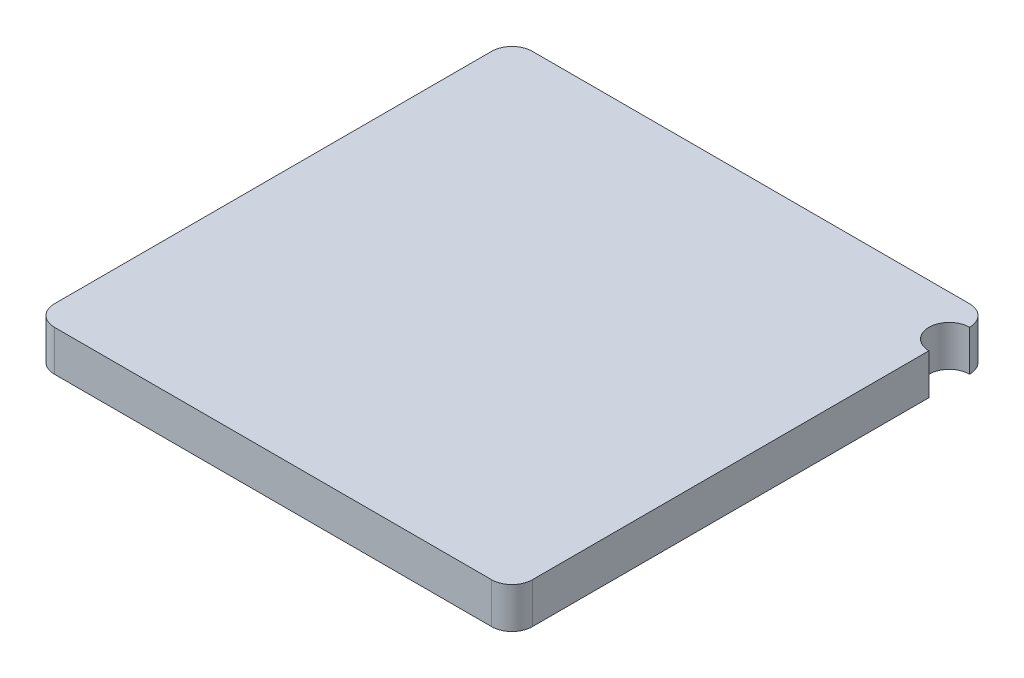
ISO-10303-21;
HEADER;
FILE_DESCRIPTION(('STEP AP214'),'2;1');
FILE_NAME('part.step','',(''),(''),'','','');
FILE_SCHEMA(('AUTOMOTIVE_DESIGN { 1 0 10303 214 1 1 1 1 }'));
ENDSEC;
DATA;
#1=APPLICATION_CONTEXT('core data for automotive mechanical design processes');
#2=APPLICATION_PROTOCOL_DEFINITION('international standard','automotive_design',2000,#1);
#3=PRODUCT_CONTEXT('',#1,'mechanical');
#4=PRODUCT('Part','Part','',(#3));
#5=PRODUCT_RELATED_PRODUCT_CATEGORY('part','',(#4));
#6=PRODUCT_DEFINITION_FORMATION('','',#4);
#7=PRODUCT_DEFINITION_CONTEXT('part definition',#1,'design');
#8=PRODUCT_DEFINITION('design','',#6,#7);
#9=PRODUCT_DEFINITION_SHAPE('','',#8);
#10=(LENGTH_UNIT() NAMED_UNIT(*) SI_UNIT(.MILLI.,.METRE.));
#11=(NAMED_UNIT(*) PLANE_ANGLE_UNIT() SI_UNIT($,.RADIAN.));
#12=(NAMED_UNIT(*) SI_UNIT($,.STERADIAN.) SOLID_ANGLE_UNIT());
#13=UNCERTAINTY_MEASURE_WITH_UNIT(LENGTH_MEASURE(1.E-05),#10,'distance_accuracy_value','');
#14=(GEOMETRIC_REPRESENTATION_CONTEXT(3) GLOBAL_UNCERTAINTY_ASSIGNED_CONTEXT((#13)) GLOBAL_UNIT_ASSIGNED_CONTEXT((#10,
#11,#12)) REPRESENTATION_CONTEXT('',''));
#15=CARTESIAN_POINT('',(0.,0.,0.));
#16=DIRECTION('',(0.,0.,1.));
#17=DIRECTION('',(1.,0.,0.));
#18=AXIS2_PLACEMENT_3D('',#15,#16,#17);
#19=CARTESIAN_POINT('',(1.175,0.2,-1.175));
#20=DIRECTION('',(-1.,0.,0.));
#21=DIRECTION('',(0.,0.,1.));
#22=AXIS2_PLACEMENT_3D('',#19,#20,#21);
#23=PLANE('',#22);
#24=DIRECTION('',(0.,0.,-1.));
#25=VECTOR('',#24,1.);
#26=CARTESIAN_POINT('',(1.175,0.,-1.175));
#27=LINE('',#26,#25);
#28=CARTESIAN_POINT('',(1.175,0.,1.075));
#29=VERTEX_POINT('',#28);
#30=CARTESIAN_POINT('',(1.175,0.,-0.875));
#31=VERTEX_POINT('',#30);
#32=EDGE_CURVE('E131',#29,#31,#27,.T.);
#33=ORIENTED_EDGE('',*,*,#32,.T.);
#34=DIRECTION('',(0.,1.,0.));
#35=VECTOR('',#34,1.);
#36=CARTESIAN_POINT('',(1.175,0.,-0.875));
#37=LINE('',#36,#35);
#38=CARTESIAN_POINT('',(1.175,0.2,-0.875));
#39=VERTEX_POINT('',#38);
#40=EDGE_CURVE('E115',#31,#39,#37,.T.);
#41=ORIENTED_EDGE('',*,*,#40,.T.);
#42=DIRECTION('',(0.,0.,-1.));
#43=VECTOR('',#42,1.);
#44=CARTESIAN_POINT('',(1.175,0.2,-1.175));
#45=LINE('',#44,#43);
#46=CARTESIAN_POINT('',(1.175,0.2,1.075));
#47=VERTEX_POINT('',#46);
#48=EDGE_CURVE('E128',#47,#39,#45,.T.);
#49=ORIENTED_EDGE('',*,*,#48,.F.);
#50=DIRECTION('',(0.,-1.,0.));
#51=VECTOR('',#50,1.);
#52=CARTESIAN_POINT('',(1.175,0.2,1.075));
#53=LINE('',#52,#51);
#54=EDGE_CURVE('E165',#47,#29,#53,.T.);
#55=ORIENTED_EDGE('',*,*,#54,.T.);
#56=EDGE_LOOP('',(#33,#41,#49,#55));
#57=FACE_BOUND('',#56,.T.);
#58=ADVANCED_FACE('F39',(#57),#23,.F.);
#59=CARTESIAN_POINT('',(-1.175,0.2,-1.175));
#60=DIRECTION('',(0.,0.,1.));
#61=DIRECTION('',(1.,0.,0.));
#62=AXIS2_PLACEMENT_3D('',#59,#60,#61);
#63=PLANE('',#62);
#64=DIRECTION('',(-1.,0.,0.));
#65=VECTOR('',#64,1.);
#66=CARTESIAN_POINT('',(-1.175,0.2,-1.175));
#67=LINE('',#66,#65);
#68=CARTESIAN_POINT('',(1.075,0.2,-1.175));
#69=VERTEX_POINT('',#68);
#70=CARTESIAN_POINT('',(-1.075,0.2,-1.175));
#71=VERTEX_POINT('',#70);
#72=EDGE_CURVE('E139',#69,#71,#67,.T.);
#73=ORIENTED_EDGE('',*,*,#72,.F.);
#74=DIRECTION('',(0.,-1.,0.));
#75=VECTOR('',#74,1.);
#76=CARTESIAN_POINT('',(1.075,0.2,-1.175));
#77=LINE('',#76,#75);
#78=CARTESIAN_POINT('',(1.075,0.,-1.175));
#79=VERTEX_POINT('',#78);
#80=EDGE_CURVE('E11',#69,#79,#77,.T.);
#81=ORIENTED_EDGE('',*,*,#80,.T.);
#82=DIRECTION('',(-1.,0.,0.));
#83=VECTOR('',#82,1.);
#84=CARTESIAN_POINT('',(-1.175,0.,-1.175));
#85=LINE('',#84,#83);
#86=CARTESIAN_POINT('',(-1.075,0.,-1.175));
#87=VERTEX_POINT('',#86);
#88=EDGE_CURVE('E157',#79,#87,#85,.T.);
#89=ORIENTED_EDGE('',*,*,#88,.T.);
#90=DIRECTION('',(0.,-1.,0.));
#91=VECTOR('',#90,1.);
#92=CARTESIAN_POINT('',(-1.075,0.2,-1.175));
#93=LINE('',#92,#91);
#94=EDGE_CURVE('E48',#87,#71,#93,.F.);
#95=ORIENTED_EDGE('',*,*,#94,.T.);
#96=EDGE_LOOP('',(#73,#81,#89,#95));
#97=FACE_BOUND('',#96,.T.);
#98=ADVANCED_FACE('F207',(#97),#63,.F.);
#99=CARTESIAN_POINT('',(-1.175,0.2,-1.175));
#100=DIRECTION('',(1.,0.,0.));
#101=DIRECTION('',(0.,0.,-1.));
#102=AXIS2_PLACEMENT_3D('',#99,#100,#101);
#103=PLANE('',#102);
#104=DIRECTION('',(0.,0.,1.));
#105=VECTOR('',#104,1.);
#106=CARTESIAN_POINT('',(-1.175,0.,-1.175));
#107=LINE('',#106,#105);
#108=CARTESIAN_POINT('',(-1.175,0.,-1.075));
#109=VERTEX_POINT('',#108);
#110=CARTESIAN_POINT('',(-1.175,0.,1.075));
#111=VERTEX_POINT('',#110);
#112=EDGE_CURVE('E147',#109,#111,#107,.T.);
#113=ORIENTED_EDGE('',*,*,#112,.T.);
#114=DIRECTION('',(0.,-1.,0.));
#115=VECTOR('',#114,1.);
#116=CARTESIAN_POINT('',(-1.175,0.2,1.075));
#117=LINE('',#116,#115);
#118=CARTESIAN_POINT('',(-1.175,0.2,1.075));
#119=VERTEX_POINT('',#118);
#120=EDGE_CURVE('E55',#111,#119,#117,.F.);
#121=ORIENTED_EDGE('',*,*,#120,.T.);
#122=DIRECTION('',(0.,0.,1.));
#123=VECTOR('',#122,1.);
#124=CARTESIAN_POINT('',(-1.175,0.2,-1.175));
#125=LINE('',#124,#123);
#126=CARTESIAN_POINT('',(-1.175,0.2,-1.075));
#127=VERTEX_POINT('',#126);
#128=EDGE_CURVE('E144',#127,#119,#125,.T.);
#129=ORIENTED_EDGE('',*,*,#128,.F.);
#130=DIRECTION('',(0.,-1.,0.));
#131=VECTOR('',#130,1.);
#132=CARTESIAN_POINT('',(-1.175,0.2,-1.075));
#133=LINE('',#132,#131);
#134=EDGE_CURVE('E198',#127,#109,#133,.T.);
#135=ORIENTED_EDGE('',*,*,#134,.T.);
#136=EDGE_LOOP('',(#113,#121,#129,#135));
#137=FACE_BOUND('',#136,.T.);
#138=ADVANCED_FACE('F213',(#137),#103,.F.);
#139=CARTESIAN_POINT('',(-1.175,0.2,1.175));
#140=DIRECTION('',(0.,0.,-1.));
#141=DIRECTION('',(-1.,0.,0.));
#142=AXIS2_PLACEMENT_3D('',#139,#140,#141);
#143=PLANE('',#142);
#144=DIRECTION('',(1.,0.,0.));
#145=VECTOR('',#144,1.);
#146=CARTESIAN_POINT('',(-1.175,0.,1.175));
#147=LINE('',#146,#145);
#148=CARTESIAN_POINT('',(-1.075,0.,1.175));
#149=VERTEX_POINT('',#148);
#150=CARTESIAN_POINT('',(1.075,0.,1.175));
#151=VERTEX_POINT('',#150);
#152=EDGE_CURVE('E140',#149,#151,#147,.T.);
#153=ORIENTED_EDGE('',*,*,#152,.T.);
#154=DIRECTION('',(0.,-1.,0.));
#155=VECTOR('',#154,1.);
#156=CARTESIAN_POINT('',(1.075,0.2,1.175));
#157=LINE('',#156,#155);
#158=CARTESIAN_POINT('',(1.075,0.2,1.175));
#159=VERTEX_POINT('',#158);
#160=EDGE_CURVE('E185',#151,#159,#157,.F.);
#161=ORIENTED_EDGE('',*,*,#160,.T.);
#162=DIRECTION('',(1.,0.,0.));
#163=VECTOR('',#162,1.);
#164=CARTESIAN_POINT('',(-1.175,0.2,1.175));
#165=LINE('',#164,#163);
#166=CARTESIAN_POINT('',(-1.075,0.2,1.175));
#167=VERTEX_POINT('',#166);
#168=EDGE_CURVE('E152',#167,#159,#165,.T.);
#169=ORIENTED_EDGE('',*,*,#168,.F.);
#170=DIRECTION('',(0.,-1.,0.));
#171=VECTOR('',#170,1.);
#172=CARTESIAN_POINT('',(-1.075,0.2,1.175));
#173=LINE('',#172,#171);
#174=EDGE_CURVE('E181',#167,#149,#173,.T.);
#175=ORIENTED_EDGE('',*,*,#174,.T.);
#176=EDGE_LOOP('',(#153,#161,#169,#175));
#177=FACE_BOUND('',#176,.T.);
#178=ADVANCED_FACE('F223',(#177),#143,.F.);
#179=CARTESIAN_POINT('',(0.,0.2,0.));
#180=DIRECTION('',(0.,1.,0.));
#181=DIRECTION('',(0.,0.,1.));
#182=AXIS2_PLACEMENT_3D('',#179,#180,#181);
#183=PLANE('',#182);
#184=CARTESIAN_POINT('',(1.175,0.2,-0.975));
#185=DIRECTION('',(0.,1.,0.));
#186=DIRECTION('',(0.,0.,1.));
#187=AXIS2_PLACEMENT_3D('',#184,#185,#186);
#188=CIRCLE('',#187,0.1);
#189=CARTESIAN_POINT('',(1.175,0.2,-1.075));
#190=VERTEX_POINT('',#189);
#191=EDGE_CURVE('E112',#190,#39,#188,.T.);
#192=ORIENTED_EDGE('',*,*,#191,.F.);
#193=CARTESIAN_POINT('',(1.075,0.2,-1.075));
#194=DIRECTION('',(0.,1.,0.));
#195=DIRECTION('',(0.,0.,1.));
#196=AXIS2_PLACEMENT_3D('',#193,#194,#195);
#197=CIRCLE('',#196,0.1);
#198=EDGE_CURVE('E190',#190,#69,#197,.T.);
#199=ORIENTED_EDGE('',*,*,#198,.T.);
#200=ORIENTED_EDGE('',*,*,#72,.T.);
#201=CARTESIAN_POINT('',(-1.075,0.2,-1.075));
#202=DIRECTION('',(0.,1.,0.));
#203=DIRECTION('',(0.,0.,1.));
#204=AXIS2_PLACEMENT_3D('',#201,#202,#203);
#205=CIRCLE('',#204,0.1);
#206=EDGE_CURVE('E62',#71,#127,#205,.T.);
#207=ORIENTED_EDGE('',*,*,#206,.T.);
#208=ORIENTED_EDGE('',*,*,#128,.T.);
#209=CARTESIAN_POINT('',(-1.075,0.2,1.075));
#210=DIRECTION('',(0.,1.,0.));
#211=DIRECTION('',(0.,0.,1.));
#212=AXIS2_PLACEMENT_3D('',#209,#210,#211);
#213=CIRCLE('',#212,0.1);
#214=EDGE_CURVE('E193',#119,#167,#213,.T.);
#215=ORIENTED_EDGE('',*,*,#214,.T.);
#216=ORIENTED_EDGE('',*,*,#168,.T.);
#217=CARTESIAN_POINT('',(1.075,0.2,1.075));
#218=DIRECTION('',(0.,1.,0.));
#219=DIRECTION('',(0.,0.,1.));
#220=AXIS2_PLACEMENT_3D('',#217,#218,#219);
#221=CIRCLE('',#220,0.1);
#222=EDGE_CURVE('E137',#159,#47,#221,.T.);
#223=ORIENTED_EDGE('',*,*,#222,.T.);
#224=ORIENTED_EDGE('',*,*,#48,.T.);
#225=EDGE_LOOP('',(#192,#199,#200,#207,#208,#215,#216,#223,#224));
#226=FACE_BOUND('',#225,.T.);
#227=ADVANCED_FACE('F134',(#226),#183,.T.);
#228=CARTESIAN_POINT('',(0.,0.,0.));
#229=DIRECTION('',(0.,1.,0.));
#230=DIRECTION('',(0.,0.,1.));
#231=AXIS2_PLACEMENT_3D('',#228,#229,#230);
#232=PLANE('',#231);
#233=CARTESIAN_POINT('',(1.075,0.,-1.075));
#234=DIRECTION('',(0.,1.,0.));
#235=DIRECTION('',(0.,0.,1.));
#236=AXIS2_PLACEMENT_3D('',#233,#234,#235);
#237=CIRCLE('',#236,0.1);
#238=CARTESIAN_POINT('',(1.175,0.,-1.075));
#239=VERTEX_POINT('',#238);
#240=EDGE_CURVE('E171',#79,#239,#237,.F.);
#241=ORIENTED_EDGE('',*,*,#240,.T.);
#242=CARTESIAN_POINT('',(1.175,0.,-0.975));
#243=DIRECTION('',(0.,1.,0.));
#244=DIRECTION('',(0.,0.,1.));
#245=AXIS2_PLACEMENT_3D('',#242,#243,#244);
#246=CIRCLE('',#245,0.1);
#247=EDGE_CURVE('E122',#239,#31,#246,.T.);
#248=ORIENTED_EDGE('',*,*,#247,.T.);
#249=ORIENTED_EDGE('',*,*,#32,.F.);
#250=CARTESIAN_POINT('',(1.075,0.,1.075));
#251=DIRECTION('',(0.,1.,0.));
#252=DIRECTION('',(0.,0.,1.));
#253=AXIS2_PLACEMENT_3D('',#250,#251,#252);
#254=CIRCLE('',#253,0.1);
#255=EDGE_CURVE('E178',#29,#151,#254,.F.);
#256=ORIENTED_EDGE('',*,*,#255,.T.);
#257=ORIENTED_EDGE('',*,*,#152,.F.);
#258=CARTESIAN_POINT('',(-1.075,0.,1.075));
#259=DIRECTION('',(0.,1.,0.));
#260=DIRECTION('',(0.,0.,1.));
#261=AXIS2_PLACEMENT_3D('',#258,#259,#260);
#262=CIRCLE('',#261,0.1);
#263=EDGE_CURVE('E175',#149,#111,#262,.F.);
#264=ORIENTED_EDGE('',*,*,#263,.T.);
#265=ORIENTED_EDGE('',*,*,#112,.F.);
#266=CARTESIAN_POINT('',(-1.075,0.,-1.075));
#267=DIRECTION('',(0.,1.,0.));
#268=DIRECTION('',(0.,0.,1.));
#269=AXIS2_PLACEMENT_3D('',#266,#267,#268);
#270=CIRCLE('',#269,0.1);
#271=EDGE_CURVE('E168',#109,#87,#270,.F.);
#272=ORIENTED_EDGE('',*,*,#271,.T.);
#273=ORIENTED_EDGE('',*,*,#88,.F.);
#274=EDGE_LOOP('',(#241,#248,#249,#256,#257,#264,#265,#272,#273));
#275=FACE_BOUND('',#274,.T.);
#276=ADVANCED_FACE('F215',(#275),#232,.F.);
#277=CARTESIAN_POINT('',(1.075,0.2,1.075));
#278=DIRECTION('',(0.,-1.,0.));
#279=DIRECTION('',(0.,0.,-1.));
#280=AXIS2_PLACEMENT_3D('',#277,#278,#279);
#281=CYLINDRICAL_SURFACE('',#280,0.1);
#282=ORIENTED_EDGE('',*,*,#222,.F.);
#283=ORIENTED_EDGE('',*,*,#160,.F.);
#284=ORIENTED_EDGE('',*,*,#255,.F.);
#285=ORIENTED_EDGE('',*,*,#54,.F.);
#286=EDGE_LOOP('',(#282,#283,#284,#285));
#287=FACE_BOUND('',#286,.T.);
#288=ADVANCED_FACE('F226',(#287),#281,.T.);
#289=CARTESIAN_POINT('',(-1.075,0.2,1.075));
#290=DIRECTION('',(0.,-1.,0.));
#291=DIRECTION('',(0.,0.,-1.));
#292=AXIS2_PLACEMENT_3D('',#289,#290,#291);
#293=CYLINDRICAL_SURFACE('',#292,0.1);
#294=ORIENTED_EDGE('',*,*,#214,.F.);
#295=ORIENTED_EDGE('',*,*,#120,.F.);
#296=ORIENTED_EDGE('',*,*,#263,.F.);
#297=ORIENTED_EDGE('',*,*,#174,.F.);
#298=EDGE_LOOP('',(#294,#295,#296,#297));
#299=FACE_BOUND('',#298,.T.);
#300=ADVANCED_FACE('F220',(#299),#293,.T.);
#301=CARTESIAN_POINT('',(1.075,0.2,-1.075));
#302=DIRECTION('',(0.,-1.,0.));
#303=DIRECTION('',(0.,0.,-1.));
#304=AXIS2_PLACEMENT_3D('',#301,#302,#303);
#305=CYLINDRICAL_SURFACE('',#304,0.1);
#306=ORIENTED_EDGE('',*,*,#198,.F.);
#307=DIRECTION('',(0.,-1.,0.));
#308=VECTOR('',#307,1.);
#309=CARTESIAN_POINT('',(1.175,0.2,-1.075));
#310=LINE('',#309,#308);
#311=EDGE_CURVE('E118',#239,#190,#310,.F.);
#312=ORIENTED_EDGE('',*,*,#311,.F.);
#313=ORIENTED_EDGE('',*,*,#240,.F.);
#314=ORIENTED_EDGE('',*,*,#80,.F.);
#315=EDGE_LOOP('',(#306,#312,#313,#314));
#316=FACE_BOUND('',#315,.T.);
#317=ADVANCED_FACE('F230',(#316),#305,.T.);
#318=CARTESIAN_POINT('',(-1.075,0.2,-1.075));
#319=DIRECTION('',(0.,-1.,0.));
#320=DIRECTION('',(0.,0.,-1.));
#321=AXIS2_PLACEMENT_3D('',#318,#319,#320);
#322=CYLINDRICAL_SURFACE('',#321,0.1);
#323=ORIENTED_EDGE('',*,*,#206,.F.);
#324=ORIENTED_EDGE('',*,*,#94,.F.);
#325=ORIENTED_EDGE('',*,*,#271,.F.);
#326=ORIENTED_EDGE('',*,*,#134,.F.);
#327=EDGE_LOOP('',(#323,#324,#325,#326));
#328=FACE_BOUND('',#327,.T.);
#329=ADVANCED_FACE('F41',(#328),#322,.T.);
#330=CARTESIAN_POINT('',(1.175,0.,-0.975));
#331=DIRECTION('',(0.,1.,0.));
#332=DIRECTION('',(0.,0.,1.));
#333=AXIS2_PLACEMENT_3D('',#330,#331,#332);
#334=CYLINDRICAL_SURFACE('',#333,0.1);
#335=ORIENTED_EDGE('',*,*,#247,.F.);
#336=ORIENTED_EDGE('',*,*,#311,.T.);
#337=ORIENTED_EDGE('',*,*,#191,.T.);
#338=ORIENTED_EDGE('',*,*,#40,.F.);
#339=EDGE_LOOP('',(#335,#336,#337,#338));
#340=FACE_BOUND('',#339,.T.);
#341=ADVANCED_FACE('F114',(#340),#334,.F.);
#342=CLOSED_SHELL('',(#58,#98,#138,#178,#227,#276,#288,#300,#317,#329,#341));
#343=MANIFOLD_SOLID_BREP('B2',#342);
#344=ADVANCED_BREP_SHAPE_REPRESENTATION('',(#18,#343),#14);
#345=SHAPE_DEFINITION_REPRESENTATION(#9,#344);
ENDSEC;
END-ISO-10303-21;
